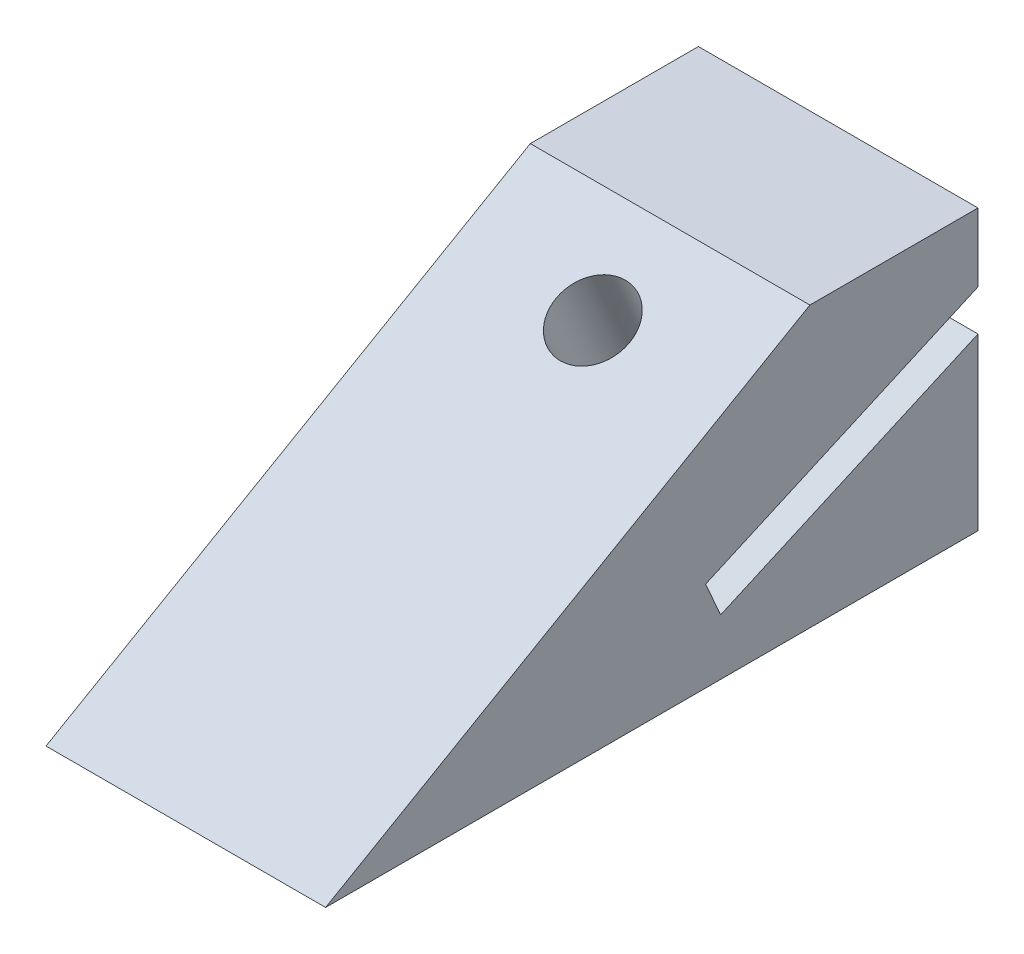
ISO-10303-21;
HEADER;
FILE_DESCRIPTION(('STEP AP214'),'2;1');
FILE_NAME('part.step','',(''),(''),'','','');
FILE_SCHEMA(('AUTOMOTIVE_DESIGN { 1 0 10303 214 1 1 1 1 }'));
ENDSEC;
DATA;
#1=APPLICATION_CONTEXT('core data for automotive mechanical design processes');
#2=APPLICATION_PROTOCOL_DEFINITION('international standard','automotive_design',2000,#1);
#3=PRODUCT_CONTEXT('',#1,'mechanical');
#4=PRODUCT('Part','Part','',(#3));
#5=PRODUCT_RELATED_PRODUCT_CATEGORY('part','',(#4));
#6=PRODUCT_DEFINITION_FORMATION('','',#4);
#7=PRODUCT_DEFINITION_CONTEXT('part definition',#1,'design');
#8=PRODUCT_DEFINITION('design','',#6,#7);
#9=PRODUCT_DEFINITION_SHAPE('','',#8);
#10=(LENGTH_UNIT() NAMED_UNIT(*) SI_UNIT(.MILLI.,.METRE.));
#11=(NAMED_UNIT(*) PLANE_ANGLE_UNIT() SI_UNIT($,.RADIAN.));
#12=(NAMED_UNIT(*) SI_UNIT($,.STERADIAN.) SOLID_ANGLE_UNIT());
#13=UNCERTAINTY_MEASURE_WITH_UNIT(LENGTH_MEASURE(1.E-05),#10,'distance_accuracy_value','');
#14=(GEOMETRIC_REPRESENTATION_CONTEXT(3) GLOBAL_UNCERTAINTY_ASSIGNED_CONTEXT((#13)) GLOBAL_UNIT_ASSIGNED_CONTEXT((#10,
#11,#12)) REPRESENTATION_CONTEXT('',''));
#15=CARTESIAN_POINT('',(0.,0.,0.));
#16=DIRECTION('',(0.,0.,1.));
#17=DIRECTION('',(1.,0.,0.));
#18=AXIS2_PLACEMENT_3D('',#15,#16,#17);
#19=CARTESIAN_POINT('',(15.,1.59329839413197E-13,-35.));
#20=DIRECTION('',(0.,0.,-1.));
#21=DIRECTION('',(0.,1.,0.));
#22=AXIS2_PLACEMENT_3D('',#19,#20,#21);
#23=PLANE('',#22);
#24=DIRECTION('',(0.,-1.,0.));
#25=VECTOR('',#24,1.);
#26=CARTESIAN_POINT('',(0.,1.59329839413197E-13,-35.));
#27=LINE('',#26,#25);
#28=CARTESIAN_POINT('',(0.,9.14560464748592,-35.));
#29=VERTEX_POINT('',#28);
#30=CARTESIAN_POINT('',(0.,0.,-35.));
#31=VERTEX_POINT('',#30);
#32=EDGE_CURVE('E133',#29,#31,#27,.T.);
#33=ORIENTED_EDGE('',*,*,#32,.F.);
#34=DIRECTION('',(-1.,0.,0.));
#35=VECTOR('',#34,1.);
#36=CARTESIAN_POINT('',(15.,9.14560464748592,-35.));
#37=LINE('',#36,#35);
#38=CARTESIAN_POINT('',(15.,9.14560464748592,-35.));
#39=VERTEX_POINT('',#38);
#40=EDGE_CURVE('E11',#39,#29,#37,.T.);
#41=ORIENTED_EDGE('',*,*,#40,.F.);
#42=DIRECTION('',(0.,-1.,0.));
#43=VECTOR('',#42,1.);
#44=CARTESIAN_POINT('',(15.,1.59329839413197E-13,-35.));
#45=LINE('',#44,#43);
#46=CARTESIAN_POINT('',(15.,0.,-35.));
#47=VERTEX_POINT('',#46);
#48=EDGE_CURVE('E152',#39,#47,#45,.T.);
#49=ORIENTED_EDGE('',*,*,#48,.T.);
#50=DIRECTION('',(-1.,0.,0.));
#51=VECTOR('',#50,1.);
#52=CARTESIAN_POINT('',(15.,0.,-35.));
#53=LINE('',#52,#51);
#54=EDGE_CURVE('E56',#47,#31,#53,.T.);
#55=ORIENTED_EDGE('',*,*,#54,.T.);
#56=EDGE_LOOP('',(#33,#41,#49,#55));
#57=FACE_BOUND('',#56,.T.);
#58=ADVANCED_FACE('F39',(#57),#23,.T.);
#59=CARTESIAN_POINT('',(15.,-5.37243013046612,-2.3919600038994));
#60=DIRECTION('',(0.,-0.913545457642601,-0.406736643075801));
#61=DIRECTION('',(0.,0.406736643075801,-0.913545457642601));
#62=AXIS2_PLACEMENT_3D('',#59,#60,#61);
#63=PLANE('',#62);
#64=CARTESIAN_POINT('',(7.5,4.82654840771143,-25.299240856906));
#65=DIRECTION('',(0.,-0.913545457642601,-0.406736643075801));
#66=DIRECTION('',(0.,0.406736643075801,-0.913545457642601));
#67=AXIS2_PLACEMENT_3D('',#64,#65,#66);
#68=CIRCLE('',#67,2.);
#69=CARTESIAN_POINT('',(7.5,5.64002169386303,-27.1263317721912));
#70=VERTEX_POINT('',#69);
#71=EDGE_CURVE('E136',#70,#70,#68,.T.);
#72=ORIENTED_EDGE('',*,*,#71,.T.);
#73=EDGE_LOOP('',(#72));
#74=FACE_BOUND('',#73,.T.);
#75=DIRECTION('',(0.,-0.406736643075801,0.913545457642601));
#76=VECTOR('',#75,1.);
#77=CARTESIAN_POINT('',(0.,-5.37243013046612,-2.3919600038994));
#78=LINE('',#77,#76);
#79=CARTESIAN_POINT('',(0.,3.,-21.19674596387));
#80=VERTEX_POINT('',#79);
#81=EDGE_CURVE('E135',#29,#80,#78,.T.);
#82=ORIENTED_EDGE('',*,*,#81,.T.);
#83=DIRECTION('',(-1.,0.,0.));
#84=VECTOR('',#83,1.);
#85=CARTESIAN_POINT('',(15.,3.,-21.19674596387));
#86=LINE('',#85,#84);
#87=CARTESIAN_POINT('',(15.,3.,-21.19674596387));
#88=VERTEX_POINT('',#87);
#89=EDGE_CURVE('E48',#88,#80,#86,.T.);
#90=ORIENTED_EDGE('',*,*,#89,.F.);
#91=DIRECTION('',(0.,-0.406736643075801,0.913545457642601));
#92=VECTOR('',#91,1.);
#93=CARTESIAN_POINT('',(15.,-5.37243013046612,-2.3919600038994));
#94=LINE('',#93,#92);
#95=EDGE_CURVE('E181',#39,#88,#94,.T.);
#96=ORIENTED_EDGE('',*,*,#95,.F.);
#97=ORIENTED_EDGE('',*,*,#40,.T.);
#98=EDGE_LOOP('',(#82,#90,#96,#97));
#99=FACE_BOUND('',#98,.T.);
#100=ADVANCED_FACE('F212',(#74,#99),#63,.F.);
#101=CARTESIAN_POINT('',(15.,8.37243013046611,-18.8047859599706));
#102=DIRECTION('',(0.,-0.4067366430758,0.913545457642601));
#103=DIRECTION('',(0.,-0.913545457642601,-0.4067366430758));
#104=AXIS2_PLACEMENT_3D('',#101,#102,#103);
#105=PLANE('',#104);
#106=DIRECTION('',(0.,0.913545457642601,0.4067366430758));
#107=VECTOR('',#106,1.);
#108=CARTESIAN_POINT('',(0.,8.37243013046611,-18.8047859599706));
#109=LINE('',#108,#107);
#110=CARTESIAN_POINT('',(0.,4.8270909152852,-20.3832726777184));
#111=VERTEX_POINT('',#110);
#112=EDGE_CURVE('E138',#80,#111,#109,.T.);
#113=ORIENTED_EDGE('',*,*,#112,.T.);
#114=DIRECTION('',(-1.,0.,0.));
#115=VECTOR('',#114,1.);
#116=CARTESIAN_POINT('',(15.,4.8270909152852,-20.3832726777184));
#117=LINE('',#116,#115);
#118=CARTESIAN_POINT('',(15.,4.8270909152852,-20.3832726777184));
#119=VERTEX_POINT('',#118);
#120=EDGE_CURVE('E158',#119,#111,#117,.T.);
#121=ORIENTED_EDGE('',*,*,#120,.F.);
#122=DIRECTION('',(0.,0.913545457642601,0.4067366430758));
#123=VECTOR('',#122,1.);
#124=CARTESIAN_POINT('',(15.,8.37243013046611,-18.8047859599706));
#125=LINE('',#124,#123);
#126=EDGE_CURVE('E168',#88,#119,#125,.T.);
#127=ORIENTED_EDGE('',*,*,#126,.F.);
#128=ORIENTED_EDGE('',*,*,#89,.T.);
#129=EDGE_LOOP('',(#113,#121,#127,#128));
#130=FACE_BOUND('',#129,.T.);
#131=ADVANCED_FACE('F166',(#130),#105,.F.);
#132=CARTESIAN_POINT('',(15.,-3.54533921518091,-1.5784867177478));
#133=DIRECTION('',(0.,0.913545457642601,0.406736643075801));
#134=DIRECTION('',(0.,-0.406736643075801,0.913545457642601));
#135=AXIS2_PLACEMENT_3D('',#132,#133,#134);
#136=PLANE('',#135);
#137=CARTESIAN_POINT('',(7.5,6.65363932299664,-24.4857675707544));
#138=DIRECTION('',(0.,0.913545457642601,0.406736643075801));
#139=DIRECTION('',(0.,-0.406736643075801,0.913545457642601));
#140=AXIS2_PLACEMENT_3D('',#137,#138,#139);
#141=CIRCLE('',#140,2.);
#142=CARTESIAN_POINT('',(7.5,5.84016603684504,-22.6586766554692));
#143=VERTEX_POINT('',#142);
#144=EDGE_CURVE('E188',#143,#143,#141,.T.);
#145=ORIENTED_EDGE('',*,*,#144,.T.);
#146=EDGE_LOOP('',(#145));
#147=FACE_BOUND('',#146,.T.);
#148=DIRECTION('',(0.,0.406736643075801,-0.913545457642601));
#149=VECTOR('',#148,1.);
#150=CARTESIAN_POINT('',(0.,-3.54533921518091,-1.5784867177478));
#151=LINE('',#150,#149);
#152=CARTESIAN_POINT('',(0.,11.334877204498,-35.));
#153=VERTEX_POINT('',#152);
#154=EDGE_CURVE('E140',#111,#153,#151,.T.);
#155=ORIENTED_EDGE('',*,*,#154,.T.);
#156=DIRECTION('',(-1.,0.,0.));
#157=VECTOR('',#156,1.);
#158=CARTESIAN_POINT('',(15.,11.334877204498,-35.));
#159=LINE('',#158,#157);
#160=CARTESIAN_POINT('',(15.,11.334877204498,-35.));
#161=VERTEX_POINT('',#160);
#162=EDGE_CURVE('E156',#161,#153,#159,.T.);
#163=ORIENTED_EDGE('',*,*,#162,.F.);
#164=DIRECTION('',(0.,0.406736643075801,-0.913545457642601));
#165=VECTOR('',#164,1.);
#166=CARTESIAN_POINT('',(15.,-3.54533921518091,-1.5784867177478));
#167=LINE('',#166,#165);
#168=EDGE_CURVE('E179',#119,#161,#167,.T.);
#169=ORIENTED_EDGE('',*,*,#168,.F.);
#170=ORIENTED_EDGE('',*,*,#120,.T.);
#171=EDGE_LOOP('',(#155,#163,#169,#170));
#172=FACE_BOUND('',#171,.T.);
#173=ADVANCED_FACE('F177',(#147,#172),#136,.F.);
#174=CARTESIAN_POINT('',(15.,1.98788390065515E-13,-35.));
#175=DIRECTION('',(0.,0.,-1.));
#176=DIRECTION('',(0.,1.,0.));
#177=AXIS2_PLACEMENT_3D('',#174,#175,#176);
#178=PLANE('',#177);
#179=DIRECTION('',(0.,-1.,0.));
#180=VECTOR('',#179,1.);
#181=CARTESIAN_POINT('',(0.,1.98788390065515E-13,-35.));
#182=LINE('',#181,#180);
#183=CARTESIAN_POINT('',(0.,15.,-34.9999999999999));
#184=VERTEX_POINT('',#183);
#185=EDGE_CURVE('E143',#184,#153,#182,.T.);
#186=ORIENTED_EDGE('',*,*,#185,.F.);
#187=DIRECTION('',(-1.,0.,0.));
#188=VECTOR('',#187,1.);
#189=CARTESIAN_POINT('',(15.,15.,-34.9999999999999));
#190=LINE('',#189,#188);
#191=CARTESIAN_POINT('',(15.,15.,-34.9999999999999));
#192=VERTEX_POINT('',#191);
#193=EDGE_CURVE('E115',#192,#184,#190,.T.);
#194=ORIENTED_EDGE('',*,*,#193,.F.);
#195=DIRECTION('',(0.,-1.,0.));
#196=VECTOR('',#195,1.);
#197=CARTESIAN_POINT('',(15.,1.98788390065515E-13,-35.));
#198=LINE('',#197,#196);
#199=EDGE_CURVE('E125',#192,#161,#198,.T.);
#200=ORIENTED_EDGE('',*,*,#199,.T.);
#201=ORIENTED_EDGE('',*,*,#162,.T.);
#202=EDGE_LOOP('',(#186,#194,#200,#201));
#203=FACE_BOUND('',#202,.T.);
#204=ADVANCED_FACE('F209',(#203),#178,.T.);
#205=CARTESIAN_POINT('',(15.,14.9999999999999,0.));
#206=DIRECTION('',(0.,1.,0.));
#207=DIRECTION('',(0.,0.,1.));
#208=AXIS2_PLACEMENT_3D('',#205,#206,#207);
#209=PLANE('',#208);
#210=DIRECTION('',(0.,0.,-1.));
#211=VECTOR('',#210,1.);
#212=CARTESIAN_POINT('',(0.,14.9999999999999,0.));
#213=LINE('',#212,#211);
#214=CARTESIAN_POINT('',(0.,15.,-25.9807621135334));
#215=VERTEX_POINT('',#214);
#216=EDGE_CURVE('E111',#215,#184,#213,.T.);
#217=ORIENTED_EDGE('',*,*,#216,.F.);
#218=DIRECTION('',(-1.,0.,0.));
#219=VECTOR('',#218,1.);
#220=CARTESIAN_POINT('',(15.,15.,-25.9807621135334));
#221=LINE('',#220,#219);
#222=CARTESIAN_POINT('',(15.,15.,-25.9807621135334));
#223=VERTEX_POINT('',#222);
#224=EDGE_CURVE('E106',#223,#215,#221,.T.);
#225=ORIENTED_EDGE('',*,*,#224,.F.);
#226=DIRECTION('',(0.,0.,-1.));
#227=VECTOR('',#226,1.);
#228=CARTESIAN_POINT('',(15.,14.9999999999999,0.));
#229=LINE('',#228,#227);
#230=EDGE_CURVE('E109',#223,#192,#229,.T.);
#231=ORIENTED_EDGE('',*,*,#230,.T.);
#232=ORIENTED_EDGE('',*,*,#193,.T.);
#233=EDGE_LOOP('',(#217,#225,#231,#232));
#234=FACE_BOUND('',#233,.T.);
#235=ADVANCED_FACE('F108',(#234),#209,.T.);
#236=CARTESIAN_POINT('',(15.,0.,0.));
#237=DIRECTION('',(0.,0.866025403784441,0.499999999999995));
#238=DIRECTION('',(0.,-0.499999999999995,0.866025403784442));
#239=AXIS2_PLACEMENT_3D('',#236,#237,#238);
#240=PLANE('',#239);
#241=CARTESIAN_POINT('',(7.5,12.6066307742487,-21.8353250132605));
#242=DIRECTION('',(0.,0.866025403784441,0.499999999999995));
#243=DIRECTION('',(0.,0.499999999999995,-0.866025403784442));
#244=AXIS2_PLACEMENT_3D('',#241,#242,#243);
#245=ELLIPSE('',#244,2.01101655912703,2.);
#246=CARTESIAN_POINT('',(7.5,13.6121390538122,-23.5769164408957));
#247=VERTEX_POINT('',#246);
#248=EDGE_CURVE('E42',#247,#247,#245,.T.);
#249=ORIENTED_EDGE('',*,*,#248,.F.);
#250=EDGE_LOOP('',(#249));
#251=FACE_BOUND('',#250,.T.);
#252=DIRECTION('',(0.,0.499999999999995,-0.866025403784442));
#253=VECTOR('',#252,1.);
#254=CARTESIAN_POINT('',(0.,0.,0.));
#255=LINE('',#254,#253);
#256=CARTESIAN_POINT('',(0.,0.,0.));
#257=VERTEX_POINT('',#256);
#258=EDGE_CURVE('E147',#257,#215,#255,.T.);
#259=ORIENTED_EDGE('',*,*,#258,.F.);
#260=DIRECTION('',(-1.,0.,0.));
#261=VECTOR('',#260,1.);
#262=CARTESIAN_POINT('',(15.,0.,0.));
#263=LINE('',#262,#261);
#264=CARTESIAN_POINT('',(15.,0.,0.));
#265=VERTEX_POINT('',#264);
#266=EDGE_CURVE('E81',#265,#257,#263,.T.);
#267=ORIENTED_EDGE('',*,*,#266,.F.);
#268=DIRECTION('',(0.,0.499999999999995,-0.866025403784442));
#269=VECTOR('',#268,1.);
#270=CARTESIAN_POINT('',(15.,0.,0.));
#271=LINE('',#270,#269);
#272=EDGE_CURVE('E123',#265,#223,#271,.T.);
#273=ORIENTED_EDGE('',*,*,#272,.T.);
#274=ORIENTED_EDGE('',*,*,#224,.T.);
#275=EDGE_LOOP('',(#259,#267,#273,#274));
#276=FACE_BOUND('',#275,.T.);
#277=ADVANCED_FACE('F127',(#251,#276),#240,.T.);
#278=CARTESIAN_POINT('',(15.,0.,0.));
#279=DIRECTION('',(0.,-1.,0.));
#280=DIRECTION('',(0.,0.,-1.));
#281=AXIS2_PLACEMENT_3D('',#278,#279,#280);
#282=PLANE('',#281);
#283=DIRECTION('',(0.,0.,1.));
#284=VECTOR('',#283,1.);
#285=CARTESIAN_POINT('',(0.,0.,0.));
#286=LINE('',#285,#284);
#287=EDGE_CURVE('E149',#31,#257,#286,.T.);
#288=ORIENTED_EDGE('',*,*,#287,.F.);
#289=ORIENTED_EDGE('',*,*,#54,.F.);
#290=DIRECTION('',(0.,0.,1.));
#291=VECTOR('',#290,1.);
#292=CARTESIAN_POINT('',(15.,0.,0.));
#293=LINE('',#292,#291);
#294=EDGE_CURVE('E128',#47,#265,#293,.T.);
#295=ORIENTED_EDGE('',*,*,#294,.T.);
#296=ORIENTED_EDGE('',*,*,#266,.T.);
#297=EDGE_LOOP('',(#288,#289,#295,#296));
#298=FACE_BOUND('',#297,.T.);
#299=ADVANCED_FACE('F202',(#298),#282,.T.);
#300=CARTESIAN_POINT('',(15.,0.,0.));
#301=DIRECTION('',(1.,0.,0.));
#302=DIRECTION('',(0.,0.,-1.));
#303=AXIS2_PLACEMENT_3D('',#300,#301,#302);
#304=PLANE('',#303);
#305=ORIENTED_EDGE('',*,*,#48,.F.);
#306=ORIENTED_EDGE('',*,*,#95,.T.);
#307=ORIENTED_EDGE('',*,*,#126,.T.);
#308=ORIENTED_EDGE('',*,*,#168,.T.);
#309=ORIENTED_EDGE('',*,*,#199,.F.);
#310=ORIENTED_EDGE('',*,*,#230,.F.);
#311=ORIENTED_EDGE('',*,*,#272,.F.);
#312=ORIENTED_EDGE('',*,*,#294,.F.);
#313=EDGE_LOOP('',(#305,#306,#307,#308,#309,#310,#311,#312));
#314=FACE_BOUND('',#313,.T.);
#315=ADVANCED_FACE('F121',(#314),#304,.T.);
#316=CARTESIAN_POINT('',(0.,0.,0.));
#317=DIRECTION('',(1.,0.,0.));
#318=DIRECTION('',(0.,0.,-1.));
#319=AXIS2_PLACEMENT_3D('',#316,#317,#318);
#320=PLANE('',#319);
#321=ORIENTED_EDGE('',*,*,#32,.T.);
#322=ORIENTED_EDGE('',*,*,#287,.T.);
#323=ORIENTED_EDGE('',*,*,#258,.T.);
#324=ORIENTED_EDGE('',*,*,#216,.T.);
#325=ORIENTED_EDGE('',*,*,#185,.T.);
#326=ORIENTED_EDGE('',*,*,#154,.F.);
#327=ORIENTED_EDGE('',*,*,#112,.F.);
#328=ORIENTED_EDGE('',*,*,#81,.F.);
#329=EDGE_LOOP('',(#321,#322,#323,#324,#325,#326,#327,#328));
#330=FACE_BOUND('',#329,.T.);
#331=ADVANCED_FACE('F173',(#330),#320,.F.);
#332=CARTESIAN_POINT('',(7.5,2.99945749242624,-26.1127141430576));
#333=DIRECTION('',(0.,0.913545457642601,0.4067366430758));
#334=DIRECTION('',(0.,-0.406736643075801,0.913545457642601));
#335=AXIS2_PLACEMENT_3D('',#332,#333,#334);
#336=CYLINDRICAL_SURFACE('',#335,2.);
#337=ORIENTED_EDGE('',*,*,#248,.T.);
#338=EDGE_LOOP('',(#337));
#339=FACE_BOUND('',#338,.T.);
#340=ORIENTED_EDGE('',*,*,#144,.F.);
#341=EDGE_LOOP('',(#340));
#342=FACE_BOUND('',#341,.T.);
#343=ADVANCED_FACE('F198',(#339,#342),#336,.F.);
#344=CARTESIAN_POINT('',(7.5,2.99945749242624,-26.1127141430576));
#345=DIRECTION('',(0.,0.913545457642601,0.406736643075801));
#346=DIRECTION('',(0.,-0.406736643075801,0.913545457642601));
#347=AXIS2_PLACEMENT_3D('',#344,#345,#346);
#348=CIRCLE('',#347,2.);
#349=CARTESIAN_POINT('',(7.5,2.18598420627464,-24.2856232277724));
#350=VERTEX_POINT('',#349);
#351=EDGE_CURVE('E191',#350,#350,#348,.T.);
#352=ORIENTED_EDGE('',*,*,#351,.F.);
#353=EDGE_LOOP('',(#352));
#354=FACE_BOUND('',#353,.T.);
#355=ORIENTED_EDGE('',*,*,#71,.F.);
#356=EDGE_LOOP('',(#355));
#357=FACE_BOUND('',#356,.T.);
#358=ADVANCED_FACE('F288',(#354,#357),#336,.F.);
#359=CARTESIAN_POINT('',(0.,-7.19952104575131,-3.205433290051));
#360=DIRECTION('',(0.,0.913545457642601,0.406736643075801));
#361=DIRECTION('',(0.,-0.406736643075801,0.913545457642601));
#362=AXIS2_PLACEMENT_3D('',#359,#360,#361);
#363=PLANE('',#362);
#364=ORIENTED_EDGE('',*,*,#351,.T.);
#365=EDGE_LOOP('',(#364));
#366=FACE_BOUND('',#365,.T.);
#367=ADVANCED_FACE('F298',(#366),#363,.T.);
#368=CLOSED_SHELL('',(#58,#100,#131,#173,#204,#235,#277,#299,#315,#331,#343,#358,#367));
#369=MANIFOLD_SOLID_BREP('B2',#368);
#370=ADVANCED_BREP_SHAPE_REPRESENTATION('',(#18,#369),#14);
#371=SHAPE_DEFINITION_REPRESENTATION(#9,#370);
ENDSEC;
END-ISO-10303-21;
